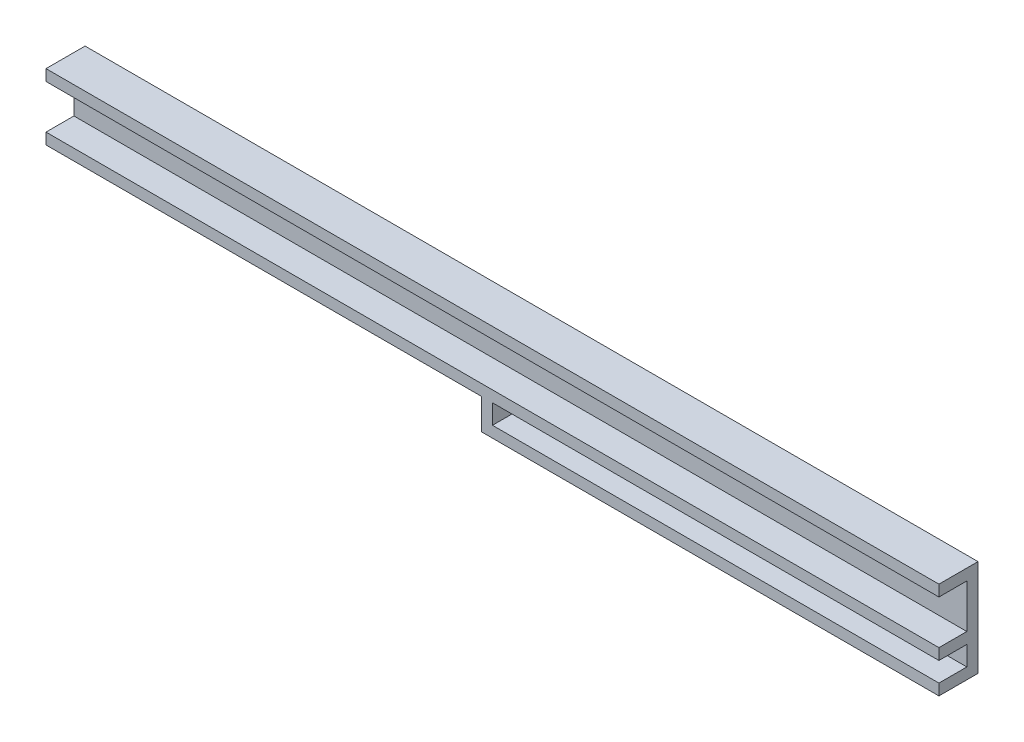
ISO-10303-21;
HEADER;
FILE_DESCRIPTION(('STEP AP214'),'2;1');
FILE_NAME('part.step','',(''),(''),'','','');
FILE_SCHEMA(('AUTOMOTIVE_DESIGN { 1 0 10303 214 1 1 1 1 }'));
ENDSEC;
DATA;
#1=APPLICATION_CONTEXT('core data for automotive mechanical design processes');
#2=APPLICATION_PROTOCOL_DEFINITION('international standard','automotive_design',2000,#1);
#3=PRODUCT_CONTEXT('',#1,'mechanical');
#4=PRODUCT('Part','Part','',(#3));
#5=PRODUCT_RELATED_PRODUCT_CATEGORY('part','',(#4));
#6=PRODUCT_DEFINITION_FORMATION('','',#4);
#7=PRODUCT_DEFINITION_CONTEXT('part definition',#1,'design');
#8=PRODUCT_DEFINITION('design','',#6,#7);
#9=PRODUCT_DEFINITION_SHAPE('','',#8);
#10=(LENGTH_UNIT() NAMED_UNIT(*) SI_UNIT(.MILLI.,.METRE.));
#11=(NAMED_UNIT(*) PLANE_ANGLE_UNIT() SI_UNIT($,.RADIAN.));
#12=(NAMED_UNIT(*) SI_UNIT($,.STERADIAN.) SOLID_ANGLE_UNIT());
#13=UNCERTAINTY_MEASURE_WITH_UNIT(LENGTH_MEASURE(1.E-05),#10,'distance_accuracy_value','');
#14=(GEOMETRIC_REPRESENTATION_CONTEXT(3) GLOBAL_UNCERTAINTY_ASSIGNED_CONTEXT((#13)) GLOBAL_UNIT_ASSIGNED_CONTEXT((#10,
#11,#12)) REPRESENTATION_CONTEXT('',''));
#15=CARTESIAN_POINT('',(0.,0.,0.));
#16=DIRECTION('',(0.,0.,1.));
#17=DIRECTION('',(1.,0.,0.));
#18=AXIS2_PLACEMENT_3D('',#15,#16,#17);
#19=CARTESIAN_POINT('',(0.,0.,0.));
#20=DIRECTION('',(0.,0.,1.));
#21=DIRECTION('',(1.,0.,0.));
#22=AXIS2_PLACEMENT_3D('',#19,#20,#21);
#23=PLANE('',#22);
#24=DIRECTION('',(1.,0.,0.));
#25=VECTOR('',#24,1.);
#26=CARTESIAN_POINT('',(0.,6.54114391143912,0.));
#27=LINE('',#26,#25);
#28=CARTESIAN_POINT('',(-39.2322075687125,6.54114391143912,0.));
#29=VERTEX_POINT('',#28);
#30=CARTESIAN_POINT('',(120.767792431288,6.54114391143914,0.));
#31=VERTEX_POINT('',#30);
#32=EDGE_CURVE('E143',#29,#31,#27,.T.);
#33=ORIENTED_EDGE('',*,*,#32,.T.);
#34=DIRECTION('',(0.,-1.,0.));
#35=VECTOR('',#34,1.);
#36=CARTESIAN_POINT('',(120.767792431288,-9.57708455645479E-13,0.));
#37=LINE('',#36,#35);
#38=CARTESIAN_POINT('',(120.767792431288,14.3911439114391,0.));
#39=VERTEX_POINT('',#38);
#40=EDGE_CURVE('E216',#39,#31,#37,.T.);
#41=ORIENTED_EDGE('',*,*,#40,.F.);
#42=DIRECTION('',(1.,0.,0.));
#43=VECTOR('',#42,1.);
#44=CARTESIAN_POINT('',(0.,14.3911439114391,0.));
#45=LINE('',#44,#43);
#46=CARTESIAN_POINT('',(-39.2322075687125,14.3911439114391,0.));
#47=VERTEX_POINT('',#46);
#48=EDGE_CURVE('E221',#47,#39,#45,.T.);
#49=ORIENTED_EDGE('',*,*,#48,.F.);
#50=DIRECTION('',(0.,-1.,0.));
#51=VECTOR('',#50,1.);
#52=CARTESIAN_POINT('',(-39.2322075687125,1.36114062967681E-13,0.));
#53=LINE('',#52,#51);
#54=EDGE_CURVE('E203',#47,#29,#53,.T.);
#55=ORIENTED_EDGE('',*,*,#54,.T.);
#56=EDGE_LOOP('',(#33,#41,#49,#55));
#57=FACE_BOUND('',#56,.T.);
#58=ADVANCED_FACE('F35',(#57),#23,.T.);
#59=CARTESIAN_POINT('',(0.,14.3911439114391,5.));
#60=DIRECTION('',(0.,1.,0.));
#61=DIRECTION('',(-1.,0.,0.));
#62=AXIS2_PLACEMENT_3D('',#59,#60,#61);
#63=PLANE('',#62);
#64=ORIENTED_EDGE('',*,*,#48,.T.);
#65=DIRECTION('',(0.,0.,-1.));
#66=VECTOR('',#65,1.);
#67=CARTESIAN_POINT('',(120.767792431288,14.3911439114391,5.));
#68=LINE('',#67,#66);
#69=CARTESIAN_POINT('',(120.767792431288,14.3911439114391,5.));
#70=VERTEX_POINT('',#69);
#71=EDGE_CURVE('E11',#70,#39,#68,.T.);
#72=ORIENTED_EDGE('',*,*,#71,.F.);
#73=DIRECTION('',(1.,0.,0.));
#74=VECTOR('',#73,1.);
#75=CARTESIAN_POINT('',(0.,14.3911439114391,5.));
#76=LINE('',#75,#74);
#77=CARTESIAN_POINT('',(-39.2322075687125,14.3911439114391,5.));
#78=VERTEX_POINT('',#77);
#79=EDGE_CURVE('E227',#78,#70,#76,.T.);
#80=ORIENTED_EDGE('',*,*,#79,.F.);
#81=DIRECTION('',(0.,0.,-1.));
#82=VECTOR('',#81,1.);
#83=CARTESIAN_POINT('',(-39.2322075687125,14.3911439114391,5.));
#84=LINE('',#83,#82);
#85=EDGE_CURVE('E238',#78,#47,#84,.T.);
#86=ORIENTED_EDGE('',*,*,#85,.T.);
#87=EDGE_LOOP('',(#64,#72,#80,#86));
#88=FACE_BOUND('',#87,.T.);
#89=ADVANCED_FACE('F37',(#88),#63,.F.);
#90=CARTESIAN_POINT('',(120.767792431287,-1.67598979737958E-12,5.));
#91=DIRECTION('',(-1.,0.,0.));
#92=DIRECTION('',(0.,-1.,0.));
#93=AXIS2_PLACEMENT_3D('',#90,#91,#92);
#94=PLANE('',#93);
#95=ORIENTED_EDGE('',*,*,#71,.T.);
#96=ORIENTED_EDGE('',*,*,#40,.T.);
#97=DIRECTION('',(0.,0.,-1.));
#98=VECTOR('',#97,1.);
#99=CARTESIAN_POINT('',(120.767792431288,6.54114391143914,5.));
#100=LINE('',#99,#98);
#101=CARTESIAN_POINT('',(120.767792431288,6.54114391143914,5.));
#102=VERTEX_POINT('',#101);
#103=EDGE_CURVE('E185',#102,#31,#100,.T.);
#104=ORIENTED_EDGE('',*,*,#103,.F.);
#105=DIRECTION('',(0.,-1.,0.));
#106=VECTOR('',#105,1.);
#107=CARTESIAN_POINT('',(120.767792431288,1.67598979737959E-12,5.));
#108=LINE('',#107,#106);
#109=CARTESIAN_POINT('',(120.767792431288,4.54114391143914,5.));
#110=VERTEX_POINT('',#109);
#111=EDGE_CURVE('E163',#102,#110,#108,.T.);
#112=ORIENTED_EDGE('',*,*,#111,.T.);
#113=DIRECTION('',(0.,0.,-1.));
#114=VECTOR('',#113,1.);
#115=CARTESIAN_POINT('',(120.767792431288,4.54114391143914,5.));
#116=LINE('',#115,#114);
#117=CARTESIAN_POINT('',(120.767792431288,4.54114391143914,0.));
#118=VERTEX_POINT('',#117);
#119=EDGE_CURVE('E191',#110,#118,#116,.T.);
#120=ORIENTED_EDGE('',*,*,#119,.T.);
#121=CARTESIAN_POINT('',(120.767792431288,1.04114391143913,0.));
#122=VERTEX_POINT('',#121);
#123=EDGE_CURVE('E146',#118,#122,#37,.T.);
#124=ORIENTED_EDGE('',*,*,#123,.T.);
#125=DIRECTION('',(0.,0.,-1.));
#126=VECTOR('',#125,1.);
#127=CARTESIAN_POINT('',(120.767792431288,1.04114391143914,5.));
#128=LINE('',#127,#126);
#129=CARTESIAN_POINT('',(120.767792431288,1.04114391143914,5.));
#130=VERTEX_POINT('',#129);
#131=EDGE_CURVE('E147',#130,#122,#128,.T.);
#132=ORIENTED_EDGE('',*,*,#131,.F.);
#133=DIRECTION('',(0.,-1.,0.));
#134=VECTOR('',#133,1.);
#135=CARTESIAN_POINT('',(120.767792431288,0.,5.));
#136=LINE('',#135,#134);
#137=CARTESIAN_POINT('',(120.767792431288,-0.958856088560861,5.));
#138=VERTEX_POINT('',#137);
#139=EDGE_CURVE('E175',#130,#138,#136,.T.);
#140=ORIENTED_EDGE('',*,*,#139,.T.);
#141=DIRECTION('',(0.,0.,1.));
#142=VECTOR('',#141,1.);
#143=CARTESIAN_POINT('',(120.767792431288,-0.958856088560861,-2.));
#144=LINE('',#143,#142);
#145=CARTESIAN_POINT('',(120.767792431288,-0.958856088560861,-2.));
#146=VERTEX_POINT('',#145);
#147=EDGE_CURVE('E222',#146,#138,#144,.T.);
#148=ORIENTED_EDGE('',*,*,#147,.F.);
#149=DIRECTION('',(0.,-1.,0.));
#150=VECTOR('',#149,1.);
#151=CARTESIAN_POINT('',(120.767792431288,-9.57708455645479E-13,-2.));
#152=LINE('',#151,#150);
#153=CARTESIAN_POINT('',(120.767792431288,16.3911439114391,-2.));
#154=VERTEX_POINT('',#153);
#155=EDGE_CURVE('E208',#154,#146,#152,.T.);
#156=ORIENTED_EDGE('',*,*,#155,.F.);
#157=DIRECTION('',(0.,0.,-1.));
#158=VECTOR('',#157,1.);
#159=CARTESIAN_POINT('',(120.767792431288,16.3911439114391,5.));
#160=LINE('',#159,#158);
#161=CARTESIAN_POINT('',(120.767792431288,16.3911439114391,5.));
#162=VERTEX_POINT('',#161);
#163=EDGE_CURVE('E43',#162,#154,#160,.T.);
#164=ORIENTED_EDGE('',*,*,#163,.F.);
#165=DIRECTION('',(0.,1.,0.));
#166=VECTOR('',#165,1.);
#167=CARTESIAN_POINT('',(120.767792431287,-1.67598979737958E-12,5.));
#168=LINE('',#167,#166);
#169=EDGE_CURVE('E230',#70,#162,#168,.T.);
#170=ORIENTED_EDGE('',*,*,#169,.F.);
#171=EDGE_LOOP('',(#95,#96,#104,#112,#120,#124,#132,#140,#148,#156,#164,#170));
#172=FACE_BOUND('',#171,.T.);
#173=ADVANCED_FACE('F255',(#172),#94,.F.);
#174=CARTESIAN_POINT('',(0.,16.3911439114391,5.));
#175=DIRECTION('',(0.,1.,0.));
#176=DIRECTION('',(-1.,0.,0.));
#177=AXIS2_PLACEMENT_3D('',#174,#175,#176);
#178=PLANE('',#177);
#179=ORIENTED_EDGE('',*,*,#163,.T.);
#180=DIRECTION('',(1.,0.,0.));
#181=VECTOR('',#180,1.);
#182=CARTESIAN_POINT('',(0.,16.3911439114391,-2.));
#183=LINE('',#182,#181);
#184=CARTESIAN_POINT('',(-39.2322075687125,16.3911439114391,-2.));
#185=VERTEX_POINT('',#184);
#186=EDGE_CURVE('E210',#185,#154,#183,.T.);
#187=ORIENTED_EDGE('',*,*,#186,.F.);
#188=DIRECTION('',(0.,0.,-1.));
#189=VECTOR('',#188,1.);
#190=CARTESIAN_POINT('',(-39.2322075687125,16.3911439114391,5.));
#191=LINE('',#190,#189);
#192=CARTESIAN_POINT('',(-39.2322075687125,16.3911439114391,5.));
#193=VERTEX_POINT('',#192);
#194=EDGE_CURVE('E243',#193,#185,#191,.T.);
#195=ORIENTED_EDGE('',*,*,#194,.F.);
#196=DIRECTION('',(1.,0.,0.));
#197=VECTOR('',#196,1.);
#198=CARTESIAN_POINT('',(0.,16.3911439114391,5.));
#199=LINE('',#198,#197);
#200=EDGE_CURVE('E232',#193,#162,#199,.T.);
#201=ORIENTED_EDGE('',*,*,#200,.T.);
#202=EDGE_LOOP('',(#179,#187,#195,#201));
#203=FACE_BOUND('',#202,.T.);
#204=ADVANCED_FACE('F247',(#203),#178,.T.);
#205=CARTESIAN_POINT('',(-39.2322075687125,0.,5.));
#206=DIRECTION('',(-1.,0.,0.));
#207=DIRECTION('',(0.,0.,1.));
#208=AXIS2_PLACEMENT_3D('',#205,#206,#207);
#209=PLANE('',#208);
#210=ORIENTED_EDGE('',*,*,#194,.T.);
#211=DIRECTION('',(0.,-1.,0.));
#212=VECTOR('',#211,1.);
#213=CARTESIAN_POINT('',(-39.2322075687125,1.36114062967681E-13,-2.));
#214=LINE('',#213,#212);
#215=CARTESIAN_POINT('',(-39.2322075687125,4.54114391143912,-2.));
#216=VERTEX_POINT('',#215);
#217=EDGE_CURVE('E213',#185,#216,#214,.T.);
#218=ORIENTED_EDGE('',*,*,#217,.T.);
#219=DIRECTION('',(0.,0.,1.));
#220=VECTOR('',#219,1.);
#221=CARTESIAN_POINT('',(-39.2322075687125,4.54114391143912,-2.));
#222=LINE('',#221,#220);
#223=CARTESIAN_POINT('',(-39.2322075687125,4.54114391143912,5.));
#224=VERTEX_POINT('',#223);
#225=EDGE_CURVE('E154',#216,#224,#222,.T.);
#226=ORIENTED_EDGE('',*,*,#225,.T.);
#227=DIRECTION('',(0.,-1.,0.));
#228=VECTOR('',#227,1.);
#229=CARTESIAN_POINT('',(-39.2322075687125,1.36114062967681E-13,5.));
#230=LINE('',#229,#228);
#231=CARTESIAN_POINT('',(-39.2322075687125,6.54114391143912,5.));
#232=VERTEX_POINT('',#231);
#233=EDGE_CURVE('E150',#232,#224,#230,.T.);
#234=ORIENTED_EDGE('',*,*,#233,.F.);
#235=DIRECTION('',(0.,0.,-1.));
#236=VECTOR('',#235,1.);
#237=CARTESIAN_POINT('',(-39.2322075687125,6.54114391143912,5.));
#238=LINE('',#237,#236);
#239=EDGE_CURVE('E136',#232,#29,#238,.T.);
#240=ORIENTED_EDGE('',*,*,#239,.T.);
#241=ORIENTED_EDGE('',*,*,#54,.F.);
#242=ORIENTED_EDGE('',*,*,#85,.F.);
#243=DIRECTION('',(0.,1.,0.));
#244=VECTOR('',#243,1.);
#245=CARTESIAN_POINT('',(-39.2322075687125,0.,5.));
#246=LINE('',#245,#244);
#247=EDGE_CURVE('E235',#78,#193,#246,.T.);
#248=ORIENTED_EDGE('',*,*,#247,.T.);
#249=EDGE_LOOP('',(#210,#218,#226,#234,#240,#241,#242,#248));
#250=FACE_BOUND('',#249,.T.);
#251=ADVANCED_FACE('F151',(#250),#209,.T.);
#252=CARTESIAN_POINT('',(0.,0.,5.));
#253=DIRECTION('',(0.,0.,1.));
#254=DIRECTION('',(1.,0.,0.));
#255=AXIS2_PLACEMENT_3D('',#252,#253,#254);
#256=PLANE('',#255);
#257=ORIENTED_EDGE('',*,*,#79,.T.);
#258=ORIENTED_EDGE('',*,*,#169,.T.);
#259=ORIENTED_EDGE('',*,*,#200,.F.);
#260=ORIENTED_EDGE('',*,*,#247,.F.);
#261=EDGE_LOOP('',(#257,#258,#259,#260));
#262=FACE_BOUND('',#261,.T.);
#263=ADVANCED_FACE('F271',(#262),#256,.T.);
#264=DIRECTION('',(1.,0.,0.));
#265=VECTOR('',#264,1.);
#266=CARTESIAN_POINT('',(0.,1.04114391143912,0.));
#267=LINE('',#266,#265);
#268=CARTESIAN_POINT('',(40.7677924312875,1.04114391143913,0.));
#269=VERTEX_POINT('',#268);
#270=EDGE_CURVE('E186',#269,#122,#267,.T.);
#271=ORIENTED_EDGE('',*,*,#270,.T.);
#272=ORIENTED_EDGE('',*,*,#123,.F.);
#273=DIRECTION('',(-1.,0.,0.));
#274=VECTOR('',#273,1.);
#275=CARTESIAN_POINT('',(0.,4.54114391143912,0.));
#276=LINE('',#275,#274);
#277=CARTESIAN_POINT('',(40.7677924312875,4.54114391143913,0.));
#278=VERTEX_POINT('',#277);
#279=EDGE_CURVE('E55',#118,#278,#276,.T.);
#280=ORIENTED_EDGE('',*,*,#279,.T.);
#281=DIRECTION('',(0.,-1.,0.));
#282=VECTOR('',#281,1.);
#283=CARTESIAN_POINT('',(40.7677924312875,0.,0.));
#284=LINE('',#283,#282);
#285=EDGE_CURVE('E50',#278,#269,#284,.T.);
#286=ORIENTED_EDGE('',*,*,#285,.T.);
#287=EDGE_LOOP('',(#271,#272,#280,#286));
#288=FACE_BOUND('',#287,.T.);
#289=ADVANCED_FACE('F278',(#288),#23,.T.);
#290=CARTESIAN_POINT('',(0.,4.54114391143912,-2.));
#291=DIRECTION('',(0.,1.,0.));
#292=DIRECTION('',(-1.,0.,0.));
#293=AXIS2_PLACEMENT_3D('',#290,#291,#292);
#294=PLANE('',#293);
#295=DIRECTION('',(0.,0.,1.));
#296=VECTOR('',#295,1.);
#297=CARTESIAN_POINT('',(38.7677924312875,4.54114391143913,-2.));
#298=LINE('',#297,#296);
#299=CARTESIAN_POINT('',(38.7677924312875,4.54114391143913,-2.));
#300=VERTEX_POINT('',#299);
#301=CARTESIAN_POINT('',(38.7677924312875,4.54114391143913,5.));
#302=VERTEX_POINT('',#301);
#303=EDGE_CURVE('E215',#300,#302,#298,.T.);
#304=ORIENTED_EDGE('',*,*,#303,.T.);
#305=DIRECTION('',(-1.,0.,0.));
#306=VECTOR('',#305,1.);
#307=CARTESIAN_POINT('',(0.,4.54114391143912,5.));
#308=LINE('',#307,#306);
#309=EDGE_CURVE('E158',#302,#224,#308,.T.);
#310=ORIENTED_EDGE('',*,*,#309,.T.);
#311=ORIENTED_EDGE('',*,*,#225,.F.);
#312=DIRECTION('',(-1.,0.,0.));
#313=VECTOR('',#312,1.);
#314=CARTESIAN_POINT('',(0.,4.54114391143912,-2.));
#315=LINE('',#314,#313);
#316=EDGE_CURVE('E200',#300,#216,#315,.T.);
#317=ORIENTED_EDGE('',*,*,#316,.F.);
#318=EDGE_LOOP('',(#304,#310,#311,#317));
#319=FACE_BOUND('',#318,.T.);
#320=ADVANCED_FACE('F268',(#319),#294,.F.);
#321=CARTESIAN_POINT('',(0.,-0.958856088560876,-2.));
#322=DIRECTION('',(0.,1.,0.));
#323=DIRECTION('',(-1.,0.,0.));
#324=AXIS2_PLACEMENT_3D('',#321,#322,#323);
#325=PLANE('',#324);
#326=ORIENTED_EDGE('',*,*,#147,.T.);
#327=DIRECTION('',(-1.,0.,0.));
#328=VECTOR('',#327,1.);
#329=CARTESIAN_POINT('',(0.,-0.958856088560878,5.));
#330=LINE('',#329,#328);
#331=CARTESIAN_POINT('',(38.7677924312875,-0.958856088560872,5.));
#332=VERTEX_POINT('',#331);
#333=EDGE_CURVE('E172',#138,#332,#330,.T.);
#334=ORIENTED_EDGE('',*,*,#333,.T.);
#335=DIRECTION('',(0.,0.,1.));
#336=VECTOR('',#335,1.);
#337=CARTESIAN_POINT('',(38.7677924312875,-0.958856088560872,-2.));
#338=LINE('',#337,#336);
#339=CARTESIAN_POINT('',(38.7677924312875,-0.958856088560872,-2.));
#340=VERTEX_POINT('',#339);
#341=EDGE_CURVE('E224',#340,#332,#338,.T.);
#342=ORIENTED_EDGE('',*,*,#341,.F.);
#343=DIRECTION('',(-1.,0.,0.));
#344=VECTOR('',#343,1.);
#345=CARTESIAN_POINT('',(0.,-0.958856088560876,-2.));
#346=LINE('',#345,#344);
#347=EDGE_CURVE('E206',#146,#340,#346,.T.);
#348=ORIENTED_EDGE('',*,*,#347,.F.);
#349=EDGE_LOOP('',(#326,#334,#342,#348));
#350=FACE_BOUND('',#349,.T.);
#351=ADVANCED_FACE('F261',(#350),#325,.F.);
#352=CARTESIAN_POINT('',(38.7677924312875,0.,-2.));
#353=DIRECTION('',(-1.,0.,0.));
#354=DIRECTION('',(0.,0.,1.));
#355=AXIS2_PLACEMENT_3D('',#352,#353,#354);
#356=PLANE('',#355);
#357=ORIENTED_EDGE('',*,*,#341,.T.);
#358=DIRECTION('',(0.,-1.,0.));
#359=VECTOR('',#358,1.);
#360=CARTESIAN_POINT('',(38.7677924312875,0.,5.));
#361=LINE('',#360,#359);
#362=EDGE_CURVE('E168',#302,#332,#361,.T.);
#363=ORIENTED_EDGE('',*,*,#362,.F.);
#364=ORIENTED_EDGE('',*,*,#303,.F.);
#365=DIRECTION('',(0.,-1.,0.));
#366=VECTOR('',#365,1.);
#367=CARTESIAN_POINT('',(38.7677924312875,0.,-2.));
#368=LINE('',#367,#366);
#369=EDGE_CURVE('E202',#300,#340,#368,.T.);
#370=ORIENTED_EDGE('',*,*,#369,.T.);
#371=EDGE_LOOP('',(#357,#363,#364,#370));
#372=FACE_BOUND('',#371,.T.);
#373=ADVANCED_FACE('F265',(#372),#356,.T.);
#374=CARTESIAN_POINT('',(0.,0.,-2.));
#375=DIRECTION('',(0.,0.,1.));
#376=DIRECTION('',(1.,0.,0.));
#377=AXIS2_PLACEMENT_3D('',#374,#375,#376);
#378=PLANE('',#377);
#379=ORIENTED_EDGE('',*,*,#316,.T.);
#380=ORIENTED_EDGE('',*,*,#217,.F.);
#381=ORIENTED_EDGE('',*,*,#186,.T.);
#382=ORIENTED_EDGE('',*,*,#155,.T.);
#383=ORIENTED_EDGE('',*,*,#347,.T.);
#384=ORIENTED_EDGE('',*,*,#369,.F.);
#385=EDGE_LOOP('',(#379,#380,#381,#382,#383,#384));
#386=FACE_BOUND('',#385,.T.);
#387=ADVANCED_FACE('F253',(#386),#378,.F.);
#388=CARTESIAN_POINT('',(0.,6.54114391143912,5.));
#389=DIRECTION('',(0.,1.,0.));
#390=DIRECTION('',(-1.,0.,0.));
#391=AXIS2_PLACEMENT_3D('',#388,#389,#390);
#392=PLANE('',#391);
#393=ORIENTED_EDGE('',*,*,#32,.F.);
#394=ORIENTED_EDGE('',*,*,#239,.F.);
#395=DIRECTION('',(1.,0.,0.));
#396=VECTOR('',#395,1.);
#397=CARTESIAN_POINT('',(0.,6.54114391143912,5.));
#398=LINE('',#397,#396);
#399=EDGE_CURVE('E141',#232,#102,#398,.T.);
#400=ORIENTED_EDGE('',*,*,#399,.T.);
#401=ORIENTED_EDGE('',*,*,#103,.T.);
#402=EDGE_LOOP('',(#393,#394,#400,#401));
#403=FACE_BOUND('',#402,.T.);
#404=ADVANCED_FACE('F138',(#403),#392,.T.);
#405=CARTESIAN_POINT('',(0.,1.04114391143912,5.));
#406=DIRECTION('',(0.,1.,0.));
#407=DIRECTION('',(-1.,0.,0.));
#408=AXIS2_PLACEMENT_3D('',#405,#406,#407);
#409=PLANE('',#408);
#410=ORIENTED_EDGE('',*,*,#270,.F.);
#411=DIRECTION('',(0.,0.,-1.));
#412=VECTOR('',#411,1.);
#413=CARTESIAN_POINT('',(40.7677924312875,1.04114391143913,5.));
#414=LINE('',#413,#412);
#415=CARTESIAN_POINT('',(40.7677924312875,1.04114391143913,5.));
#416=VERTEX_POINT('',#415);
#417=EDGE_CURVE('E196',#416,#269,#414,.T.);
#418=ORIENTED_EDGE('',*,*,#417,.F.);
#419=DIRECTION('',(1.,0.,0.));
#420=VECTOR('',#419,1.);
#421=CARTESIAN_POINT('',(0.,1.04114391143912,5.));
#422=LINE('',#421,#420);
#423=EDGE_CURVE('E178',#416,#130,#422,.T.);
#424=ORIENTED_EDGE('',*,*,#423,.T.);
#425=ORIENTED_EDGE('',*,*,#131,.T.);
#426=EDGE_LOOP('',(#410,#418,#424,#425));
#427=FACE_BOUND('',#426,.T.);
#428=ADVANCED_FACE('F294',(#427),#409,.T.);
#429=CARTESIAN_POINT('',(40.7677924312875,0.,5.));
#430=DIRECTION('',(1.,0.,0.));
#431=DIRECTION('',(0.,0.,-1.));
#432=AXIS2_PLACEMENT_3D('',#429,#430,#431);
#433=PLANE('',#432);
#434=ORIENTED_EDGE('',*,*,#285,.F.);
#435=DIRECTION('',(0.,0.,-1.));
#436=VECTOR('',#435,1.);
#437=CARTESIAN_POINT('',(40.7677924312875,4.54114391143913,5.));
#438=LINE('',#437,#436);
#439=CARTESIAN_POINT('',(40.7677924312875,4.54114391143913,5.));
#440=VERTEX_POINT('',#439);
#441=EDGE_CURVE('E194',#440,#278,#438,.T.);
#442=ORIENTED_EDGE('',*,*,#441,.F.);
#443=DIRECTION('',(0.,-1.,0.));
#444=VECTOR('',#443,1.);
#445=CARTESIAN_POINT('',(40.7677924312875,0.,5.));
#446=LINE('',#445,#444);
#447=EDGE_CURVE('E181',#440,#416,#446,.T.);
#448=ORIENTED_EDGE('',*,*,#447,.T.);
#449=ORIENTED_EDGE('',*,*,#417,.T.);
#450=EDGE_LOOP('',(#434,#442,#448,#449));
#451=FACE_BOUND('',#450,.T.);
#452=ADVANCED_FACE('F299',(#451),#433,.T.);
#453=CARTESIAN_POINT('',(0.,4.54114391143912,5.));
#454=DIRECTION('',(0.,-1.,0.));
#455=DIRECTION('',(1.,0.,0.));
#456=AXIS2_PLACEMENT_3D('',#453,#454,#455);
#457=PLANE('',#456);
#458=ORIENTED_EDGE('',*,*,#279,.F.);
#459=ORIENTED_EDGE('',*,*,#119,.F.);
#460=EDGE_CURVE('E169',#110,#440,#308,.T.);
#461=ORIENTED_EDGE('',*,*,#460,.T.);
#462=ORIENTED_EDGE('',*,*,#441,.T.);
#463=EDGE_LOOP('',(#458,#459,#461,#462));
#464=FACE_BOUND('',#463,.T.);
#465=ADVANCED_FACE('F301',(#464),#457,.T.);
#466=CARTESIAN_POINT('',(0.,0.,5.));
#467=DIRECTION('',(0.,0.,1.));
#468=DIRECTION('',(1.,0.,0.));
#469=AXIS2_PLACEMENT_3D('',#466,#467,#468);
#470=PLANE('',#469);
#471=ORIENTED_EDGE('',*,*,#399,.F.);
#472=ORIENTED_EDGE('',*,*,#233,.T.);
#473=ORIENTED_EDGE('',*,*,#309,.F.);
#474=ORIENTED_EDGE('',*,*,#362,.T.);
#475=ORIENTED_EDGE('',*,*,#333,.F.);
#476=ORIENTED_EDGE('',*,*,#139,.F.);
#477=ORIENTED_EDGE('',*,*,#423,.F.);
#478=ORIENTED_EDGE('',*,*,#447,.F.);
#479=ORIENTED_EDGE('',*,*,#460,.F.);
#480=ORIENTED_EDGE('',*,*,#111,.F.);
#481=EDGE_LOOP('',(#471,#472,#473,#474,#475,#476,#477,#478,#479,#480));
#482=FACE_BOUND('',#481,.T.);
#483=ADVANCED_FACE('F160',(#482),#470,.T.);
#484=CLOSED_SHELL('',(#58,#89,#173,#204,#251,#263,#289,#320,#351,#373,#387,#404,#428,#452,#465,#483));
#485=MANIFOLD_SOLID_BREP('B2',#484);
#486=ADVANCED_BREP_SHAPE_REPRESENTATION('',(#18,#485),#14);
#487=SHAPE_DEFINITION_REPRESENTATION(#9,#486);
ENDSEC;
END-ISO-10303-21;
